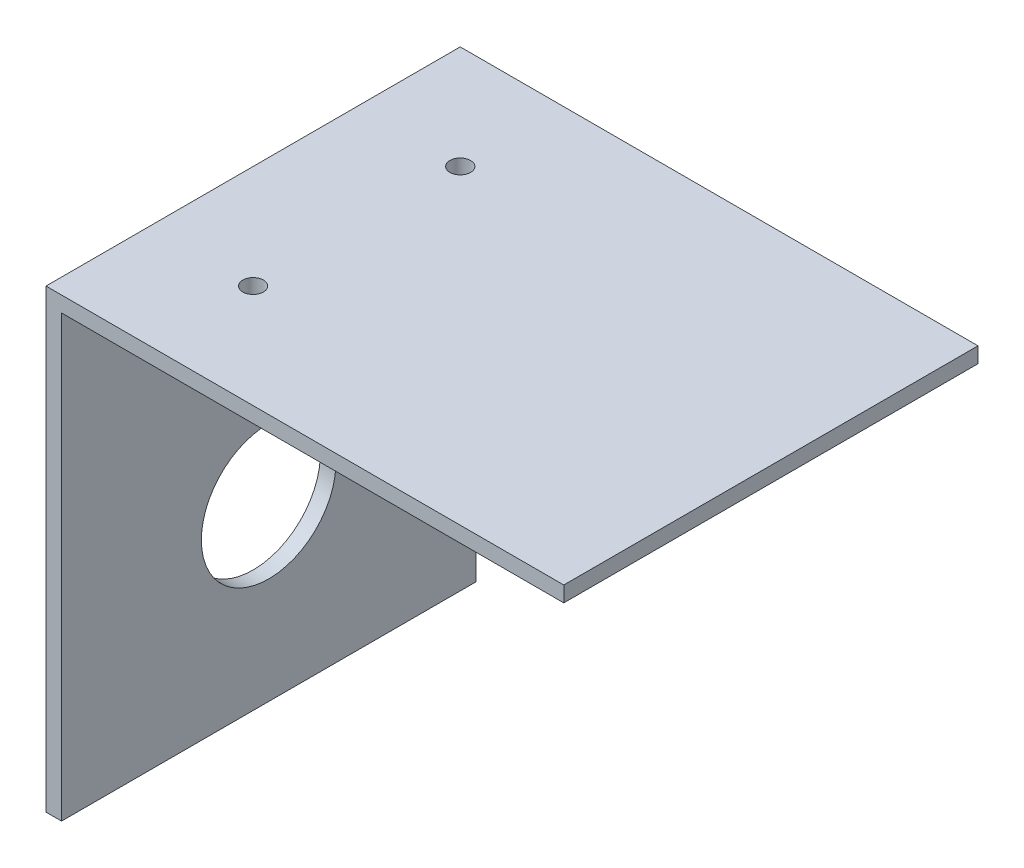
ISO-10303-21;
HEADER;
FILE_DESCRIPTION(('STEP AP214'),'2;1');
FILE_NAME('part.step','',(''),(''),'','','');
FILE_SCHEMA(('AUTOMOTIVE_DESIGN { 1 0 10303 214 1 1 1 1 }'));
ENDSEC;
DATA;
#1=APPLICATION_CONTEXT('core data for automotive mechanical design processes');
#2=APPLICATION_PROTOCOL_DEFINITION('international standard','automotive_design',2000,#1);
#3=PRODUCT_CONTEXT('',#1,'mechanical');
#4=PRODUCT('Part','Part','',(#3));
#5=PRODUCT_RELATED_PRODUCT_CATEGORY('part','',(#4));
#6=PRODUCT_DEFINITION_FORMATION('','',#4);
#7=PRODUCT_DEFINITION_CONTEXT('part definition',#1,'design');
#8=PRODUCT_DEFINITION('design','',#6,#7);
#9=PRODUCT_DEFINITION_SHAPE('','',#8);
#10=(LENGTH_UNIT() NAMED_UNIT(*) SI_UNIT(.MILLI.,.METRE.));
#11=(NAMED_UNIT(*) PLANE_ANGLE_UNIT() SI_UNIT($,.RADIAN.));
#12=(NAMED_UNIT(*) SI_UNIT($,.STERADIAN.) SOLID_ANGLE_UNIT());
#13=UNCERTAINTY_MEASURE_WITH_UNIT(LENGTH_MEASURE(1.E-05),#10,'distance_accuracy_value','');
#14=(GEOMETRIC_REPRESENTATION_CONTEXT(3) GLOBAL_UNCERTAINTY_ASSIGNED_CONTEXT((#13)) GLOBAL_UNIT_ASSIGNED_CONTEXT((#10,
#11,#12)) REPRESENTATION_CONTEXT('',''));
#15=CARTESIAN_POINT('',(0.,0.,0.));
#16=DIRECTION('',(0.,0.,1.));
#17=DIRECTION('',(1.,0.,0.));
#18=AXIS2_PLACEMENT_3D('',#15,#16,#17);
#19=CARTESIAN_POINT('',(-50.,3.,-40.));
#20=DIRECTION('',(0.,0.,1.));
#21=DIRECTION('',(1.,0.,0.));
#22=AXIS2_PLACEMENT_3D('',#19,#20,#21);
#23=PLANE('',#22);
#24=DIRECTION('',(1.,0.,0.));
#25=VECTOR('',#24,1.);
#26=CARTESIAN_POINT('',(-50.,-85.,-40.));
#27=LINE('',#26,#25);
#28=CARTESIAN_POINT('',(-50.,-85.,-40.));
#29=VERTEX_POINT('',#28);
#30=CARTESIAN_POINT('',(-47.,-85.,-40.));
#31=VERTEX_POINT('',#30);
#32=EDGE_CURVE('E58',#29,#31,#27,.T.);
#33=ORIENTED_EDGE('',*,*,#32,.F.);
#34=DIRECTION('',(0.,-1.,0.));
#35=VECTOR('',#34,1.);
#36=CARTESIAN_POINT('',(-50.,3.,-40.));
#37=LINE('',#36,#35);
#38=CARTESIAN_POINT('',(-50.,3.,-40.));
#39=VERTEX_POINT('',#38);
#40=EDGE_CURVE('E50',#39,#29,#37,.T.);
#41=ORIENTED_EDGE('',*,*,#40,.F.);
#42=DIRECTION('',(-1.,0.,0.));
#43=VECTOR('',#42,1.);
#44=CARTESIAN_POINT('',(-50.,3.,-40.));
#45=LINE('',#44,#43);
#46=CARTESIAN_POINT('',(50.,3.,-40.));
#47=VERTEX_POINT('',#46);
#48=EDGE_CURVE('E159',#47,#39,#45,.T.);
#49=ORIENTED_EDGE('',*,*,#48,.F.);
#50=DIRECTION('',(0.,-1.,0.));
#51=VECTOR('',#50,1.);
#52=CARTESIAN_POINT('',(50.,3.,-40.));
#53=LINE('',#52,#51);
#54=CARTESIAN_POINT('',(50.,0.,-40.));
#55=VERTEX_POINT('',#54);
#56=EDGE_CURVE('E11',#47,#55,#53,.T.);
#57=ORIENTED_EDGE('',*,*,#56,.T.);
#58=DIRECTION('',(-1.,0.,0.));
#59=VECTOR('',#58,1.);
#60=CARTESIAN_POINT('',(-50.,0.,-40.));
#61=LINE('',#60,#59);
#62=CARTESIAN_POINT('',(-47.,0.,-40.));
#63=VERTEX_POINT('',#62);
#64=EDGE_CURVE('E171',#55,#63,#61,.T.);
#65=ORIENTED_EDGE('',*,*,#64,.T.);
#66=DIRECTION('',(0.,1.,0.));
#67=VECTOR('',#66,1.);
#68=CARTESIAN_POINT('',(-47.,-100.,-40.));
#69=LINE('',#68,#67);
#70=EDGE_CURVE('E65',#31,#63,#69,.T.);
#71=ORIENTED_EDGE('',*,*,#70,.F.);
#72=EDGE_LOOP('',(#33,#41,#49,#57,#65,#71));
#73=FACE_BOUND('',#72,.T.);
#74=ADVANCED_FACE('F40',(#73),#23,.F.);
#75=CARTESIAN_POINT('',(-50.,3.,40.));
#76=DIRECTION('',(1.,0.,0.));
#77=DIRECTION('',(0.,0.,-1.));
#78=AXIS2_PLACEMENT_3D('',#75,#76,#77);
#79=PLANE('',#78);
#80=CARTESIAN_POINT('',(-50.,-51.5,0.));
#81=DIRECTION('',(-1.,0.,0.));
#82=DIRECTION('',(0.,0.,1.));
#83=AXIS2_PLACEMENT_3D('',#80,#81,#82);
#84=CIRCLE('',#83,13.);
#85=CARTESIAN_POINT('',(-50.,-51.5,13.));
#86=VERTEX_POINT('',#85);
#87=EDGE_CURVE('E143',#86,#86,#84,.T.);
#88=ORIENTED_EDGE('',*,*,#87,.F.);
#89=EDGE_LOOP('',(#88));
#90=FACE_BOUND('',#89,.T.);
#91=DIRECTION('',(0.,0.,-1.));
#92=VECTOR('',#91,1.);
#93=CARTESIAN_POINT('',(-50.,-85.,40.));
#94=LINE('',#93,#92);
#95=CARTESIAN_POINT('',(-50.,-85.,40.));
#96=VERTEX_POINT('',#95);
#97=EDGE_CURVE('E95',#96,#29,#94,.T.);
#98=ORIENTED_EDGE('',*,*,#97,.F.);
#99=DIRECTION('',(0.,-1.,0.));
#100=VECTOR('',#99,1.);
#101=CARTESIAN_POINT('',(-50.,3.,40.));
#102=LINE('',#101,#100);
#103=CARTESIAN_POINT('',(-50.,3.,40.));
#104=VERTEX_POINT('',#103);
#105=EDGE_CURVE('E115',#104,#96,#102,.T.);
#106=ORIENTED_EDGE('',*,*,#105,.F.);
#107=DIRECTION('',(0.,0.,1.));
#108=VECTOR('',#107,1.);
#109=CARTESIAN_POINT('',(-50.,3.,40.));
#110=LINE('',#109,#108);
#111=EDGE_CURVE('E113',#39,#104,#110,.T.);
#112=ORIENTED_EDGE('',*,*,#111,.F.);
#113=ORIENTED_EDGE('',*,*,#40,.T.);
#114=EDGE_LOOP('',(#98,#106,#112,#113));
#115=FACE_BOUND('',#114,.T.);
#116=ADVANCED_FACE('F112',(#90,#115),#79,.F.);
#117=CARTESIAN_POINT('',(-50.,3.,40.));
#118=DIRECTION('',(0.,0.,-1.));
#119=DIRECTION('',(-1.,0.,0.));
#120=AXIS2_PLACEMENT_3D('',#117,#118,#119);
#121=PLANE('',#120);
#122=DIRECTION('',(-1.,0.,0.));
#123=VECTOR('',#122,1.);
#124=CARTESIAN_POINT('',(-50.,-85.,40.));
#125=LINE('',#124,#123);
#126=CARTESIAN_POINT('',(-47.,-85.,40.));
#127=VERTEX_POINT('',#126);
#128=EDGE_CURVE('E98',#127,#96,#125,.T.);
#129=ORIENTED_EDGE('',*,*,#128,.F.);
#130=DIRECTION('',(0.,1.,0.));
#131=VECTOR('',#130,1.);
#132=CARTESIAN_POINT('',(-47.,-100.,40.));
#133=LINE('',#132,#131);
#134=CARTESIAN_POINT('',(-47.,0.,40.));
#135=VERTEX_POINT('',#134);
#136=EDGE_CURVE('E149',#127,#135,#133,.T.);
#137=ORIENTED_EDGE('',*,*,#136,.T.);
#138=DIRECTION('',(1.,0.,0.));
#139=VECTOR('',#138,1.);
#140=CARTESIAN_POINT('',(-50.,0.,40.));
#141=LINE('',#140,#139);
#142=CARTESIAN_POINT('',(50.,0.,40.));
#143=VERTEX_POINT('',#142);
#144=EDGE_CURVE('E160',#135,#143,#141,.T.);
#145=ORIENTED_EDGE('',*,*,#144,.T.);
#146=DIRECTION('',(0.,-1.,0.));
#147=VECTOR('',#146,1.);
#148=CARTESIAN_POINT('',(50.,3.,40.));
#149=LINE('',#148,#147);
#150=CARTESIAN_POINT('',(50.,3.,40.));
#151=VERTEX_POINT('',#150);
#152=EDGE_CURVE('E118',#151,#143,#149,.T.);
#153=ORIENTED_EDGE('',*,*,#152,.F.);
#154=DIRECTION('',(1.,0.,0.));
#155=VECTOR('',#154,1.);
#156=CARTESIAN_POINT('',(-50.,3.,40.));
#157=LINE('',#156,#155);
#158=EDGE_CURVE('E165',#104,#151,#157,.T.);
#159=ORIENTED_EDGE('',*,*,#158,.F.);
#160=ORIENTED_EDGE('',*,*,#105,.T.);
#161=EDGE_LOOP('',(#129,#137,#145,#153,#159,#160));
#162=FACE_BOUND('',#161,.T.);
#163=ADVANCED_FACE('F189',(#162),#121,.F.);
#164=CARTESIAN_POINT('',(-47.,-100.,40.));
#165=DIRECTION('',(-1.,0.,0.));
#166=DIRECTION('',(0.,0.,1.));
#167=AXIS2_PLACEMENT_3D('',#164,#165,#166);
#168=PLANE('',#167);
#169=CARTESIAN_POINT('',(-47.,-51.5,0.));
#170=DIRECTION('',(-1.,0.,0.));
#171=DIRECTION('',(0.,0.,1.));
#172=AXIS2_PLACEMENT_3D('',#169,#170,#171);
#173=CIRCLE('',#172,13.);
#174=CARTESIAN_POINT('',(-47.,-51.5,13.));
#175=VERTEX_POINT('',#174);
#176=EDGE_CURVE('E44',#175,#175,#173,.T.);
#177=ORIENTED_EDGE('',*,*,#176,.T.);
#178=EDGE_LOOP('',(#177));
#179=FACE_BOUND('',#178,.T.);
#180=DIRECTION('',(0.,0.,1.));
#181=VECTOR('',#180,1.);
#182=CARTESIAN_POINT('',(-47.,-85.,40.));
#183=LINE('',#182,#181);
#184=EDGE_CURVE('E110',#31,#127,#183,.T.);
#185=ORIENTED_EDGE('',*,*,#184,.F.);
#186=ORIENTED_EDGE('',*,*,#70,.T.);
#187=DIRECTION('',(0.,0.,1.));
#188=VECTOR('',#187,1.);
#189=CARTESIAN_POINT('',(-47.,0.,40.));
#190=LINE('',#189,#188);
#191=EDGE_CURVE('E125',#63,#135,#190,.T.);
#192=ORIENTED_EDGE('',*,*,#191,.T.);
#193=ORIENTED_EDGE('',*,*,#136,.F.);
#194=EDGE_LOOP('',(#185,#186,#192,#193));
#195=FACE_BOUND('',#194,.T.);
#196=ADVANCED_FACE('F192',(#179,#195),#168,.F.);
#197=CARTESIAN_POINT('',(50.,3.,40.));
#198=DIRECTION('',(-1.,0.,0.));
#199=DIRECTION('',(0.,0.,1.));
#200=AXIS2_PLACEMENT_3D('',#197,#198,#199);
#201=PLANE('',#200);
#202=DIRECTION('',(0.,0.,-1.));
#203=VECTOR('',#202,1.);
#204=CARTESIAN_POINT('',(50.,0.,40.));
#205=LINE('',#204,#203);
#206=EDGE_CURVE('E154',#143,#55,#205,.T.);
#207=ORIENTED_EDGE('',*,*,#206,.T.);
#208=ORIENTED_EDGE('',*,*,#56,.F.);
#209=DIRECTION('',(0.,0.,-1.));
#210=VECTOR('',#209,1.);
#211=CARTESIAN_POINT('',(50.,3.,40.));
#212=LINE('',#211,#210);
#213=EDGE_CURVE('E155',#151,#47,#212,.T.);
#214=ORIENTED_EDGE('',*,*,#213,.F.);
#215=ORIENTED_EDGE('',*,*,#152,.T.);
#216=EDGE_LOOP('',(#207,#208,#214,#215));
#217=FACE_BOUND('',#216,.T.);
#218=ADVANCED_FACE('F42',(#217),#201,.F.);
#219=CARTESIAN_POINT('',(0.,3.,0.));
#220=DIRECTION('',(0.,-1.,0.));
#221=DIRECTION('',(0.,0.,-1.));
#222=AXIS2_PLACEMENT_3D('',#219,#220,#221);
#223=PLANE('',#222);
#224=CARTESIAN_POINT('',(-30.,3.,-20.));
#225=DIRECTION('',(0.,1.,0.));
#226=DIRECTION('',(0.,0.,1.));
#227=AXIS2_PLACEMENT_3D('',#224,#225,#226);
#228=CIRCLE('',#227,2.00000000000001);
#229=CARTESIAN_POINT('',(-30.,3.,-18.));
#230=VERTEX_POINT('',#229);
#231=EDGE_CURVE('E130',#230,#230,#228,.T.);
#232=ORIENTED_EDGE('',*,*,#231,.F.);
#233=EDGE_LOOP('',(#232));
#234=FACE_BOUND('',#233,.T.);
#235=CARTESIAN_POINT('',(-30.,3.,20.));
#236=DIRECTION('',(0.,1.,0.));
#237=DIRECTION('',(0.,0.,1.));
#238=AXIS2_PLACEMENT_3D('',#235,#236,#237);
#239=CIRCLE('',#238,2.00000000000001);
#240=CARTESIAN_POINT('',(-30.,3.,22.));
#241=VERTEX_POINT('',#240);
#242=EDGE_CURVE('E126',#241,#241,#239,.T.);
#243=ORIENTED_EDGE('',*,*,#242,.F.);
#244=EDGE_LOOP('',(#243));
#245=FACE_BOUND('',#244,.T.);
#246=ORIENTED_EDGE('',*,*,#213,.T.);
#247=ORIENTED_EDGE('',*,*,#48,.T.);
#248=ORIENTED_EDGE('',*,*,#111,.T.);
#249=ORIENTED_EDGE('',*,*,#158,.T.);
#250=EDGE_LOOP('',(#246,#247,#248,#249));
#251=FACE_BOUND('',#250,.T.);
#252=ADVANCED_FACE('F188',(#234,#245,#251),#223,.F.);
#253=CARTESIAN_POINT('',(0.,0.,0.));
#254=DIRECTION('',(0.,-1.,0.));
#255=DIRECTION('',(0.,0.,-1.));
#256=AXIS2_PLACEMENT_3D('',#253,#254,#255);
#257=PLANE('',#256);
#258=CARTESIAN_POINT('',(-30.,0.,-20.));
#259=DIRECTION('',(0.,-1.,0.));
#260=DIRECTION('',(0.,0.,-1.));
#261=AXIS2_PLACEMENT_3D('',#258,#259,#260);
#262=CIRCLE('',#261,2.00000000000001);
#263=CARTESIAN_POINT('',(-30.,0.,-22.));
#264=VERTEX_POINT('',#263);
#265=EDGE_CURVE('E127',#264,#264,#262,.T.);
#266=ORIENTED_EDGE('',*,*,#265,.F.);
#267=EDGE_LOOP('',(#266));
#268=FACE_BOUND('',#267,.T.);
#269=CARTESIAN_POINT('',(-30.,0.,20.));
#270=DIRECTION('',(0.,-1.,0.));
#271=DIRECTION('',(0.,0.,-1.));
#272=AXIS2_PLACEMENT_3D('',#269,#270,#271);
#273=CIRCLE('',#272,2.00000000000001);
#274=CARTESIAN_POINT('',(-30.,0.,18.));
#275=VERTEX_POINT('',#274);
#276=EDGE_CURVE('E122',#275,#275,#273,.T.);
#277=ORIENTED_EDGE('',*,*,#276,.F.);
#278=EDGE_LOOP('',(#277));
#279=FACE_BOUND('',#278,.T.);
#280=ORIENTED_EDGE('',*,*,#191,.F.);
#281=ORIENTED_EDGE('',*,*,#64,.F.);
#282=ORIENTED_EDGE('',*,*,#206,.F.);
#283=ORIENTED_EDGE('',*,*,#144,.F.);
#284=EDGE_LOOP('',(#280,#281,#282,#283));
#285=FACE_BOUND('',#284,.T.);
#286=ADVANCED_FACE('F186',(#268,#279,#285),#257,.T.);
#287=CARTESIAN_POINT('',(-30.,-58.,20.));
#288=DIRECTION('',(0.,1.,0.));
#289=DIRECTION('',(0.,0.,1.));
#290=AXIS2_PLACEMENT_3D('',#287,#288,#289);
#291=CYLINDRICAL_SURFACE('',#290,2.00000000000001);
#292=ORIENTED_EDGE('',*,*,#276,.T.);
#293=EDGE_LOOP('',(#292));
#294=FACE_BOUND('',#293,.T.);
#295=ORIENTED_EDGE('',*,*,#242,.T.);
#296=EDGE_LOOP('',(#295));
#297=FACE_BOUND('',#296,.T.);
#298=ADVANCED_FACE('F212',(#294,#297),#291,.F.);
#299=CARTESIAN_POINT('',(-30.,-58.,-20.));
#300=DIRECTION('',(0.,1.,0.));
#301=DIRECTION('',(0.,0.,1.));
#302=AXIS2_PLACEMENT_3D('',#299,#300,#301);
#303=CYLINDRICAL_SURFACE('',#302,2.00000000000001);
#304=ORIENTED_EDGE('',*,*,#265,.T.);
#305=EDGE_LOOP('',(#304));
#306=FACE_BOUND('',#305,.T.);
#307=ORIENTED_EDGE('',*,*,#231,.T.);
#308=EDGE_LOOP('',(#307));
#309=FACE_BOUND('',#308,.T.);
#310=ADVANCED_FACE('F222',(#306,#309),#303,.F.);
#311=CARTESIAN_POINT('',(-40.,-51.5,0.));
#312=DIRECTION('',(-1.,0.,0.));
#313=DIRECTION('',(0.,0.,1.));
#314=AXIS2_PLACEMENT_3D('',#311,#312,#313);
#315=CYLINDRICAL_SURFACE('',#314,13.);
#316=ORIENTED_EDGE('',*,*,#87,.T.);
#317=EDGE_LOOP('',(#316));
#318=FACE_BOUND('',#317,.T.);
#319=ORIENTED_EDGE('',*,*,#176,.F.);
#320=EDGE_LOOP('',(#319));
#321=FACE_BOUND('',#320,.T.);
#322=ADVANCED_FACE('F199',(#318,#321),#315,.F.);
#323=CARTESIAN_POINT('',(0.,-85.,0.));
#324=DIRECTION('',(0.,-1.,0.));
#325=DIRECTION('',(0.,0.,-1.));
#326=AXIS2_PLACEMENT_3D('',#323,#324,#325);
#327=PLANE('',#326);
#328=ORIENTED_EDGE('',*,*,#97,.T.);
#329=ORIENTED_EDGE('',*,*,#32,.T.);
#330=ORIENTED_EDGE('',*,*,#184,.T.);
#331=ORIENTED_EDGE('',*,*,#128,.T.);
#332=EDGE_LOOP('',(#328,#329,#330,#331));
#333=FACE_BOUND('',#332,.T.);
#334=ADVANCED_FACE('F96',(#333),#327,.T.);
#335=CLOSED_SHELL('',(#74,#116,#163,#196,#218,#252,#286,#298,#310,#322,#334));
#336=MANIFOLD_SOLID_BREP('B2',#335);
#337=ADVANCED_BREP_SHAPE_REPRESENTATION('',(#18,#336),#14);
#338=SHAPE_DEFINITION_REPRESENTATION(#9,#337);
ENDSEC;
END-ISO-10303-21;
